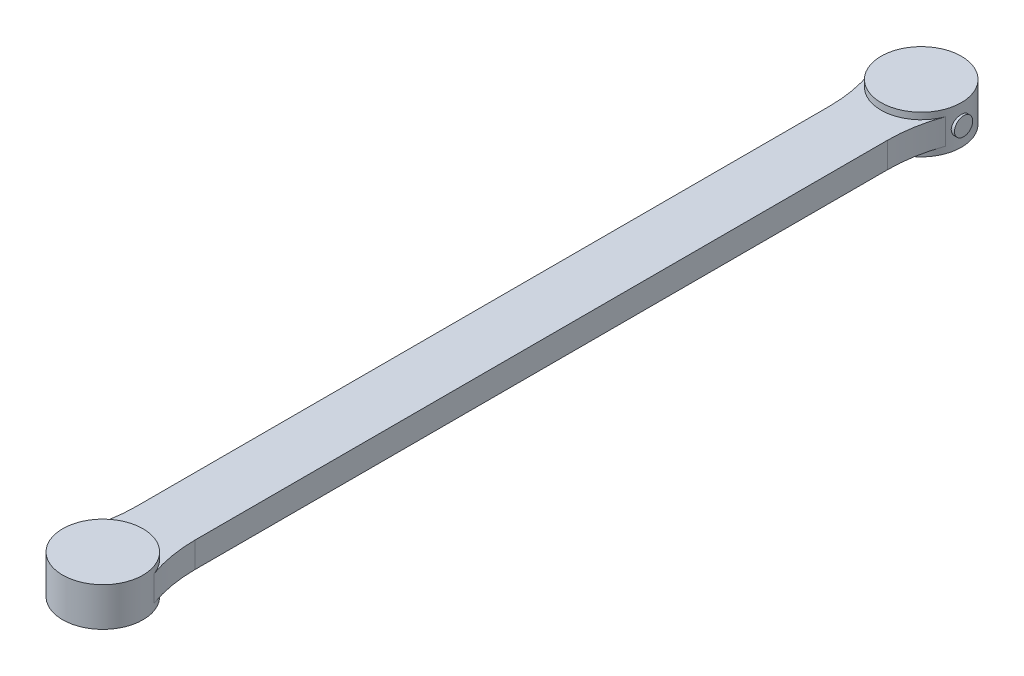
ISO-10303-21;
HEADER;
FILE_DESCRIPTION(('STEP AP214'),'2;1');
FILE_NAME('part.step','',(''),(''),'','','');
FILE_SCHEMA(('AUTOMOTIVE_DESIGN { 1 0 10303 214 1 1 1 1 }'));
ENDSEC;
DATA;
#1=APPLICATION_CONTEXT('core data for automotive mechanical design processes');
#2=APPLICATION_PROTOCOL_DEFINITION('international standard','automotive_design',2000,#1);
#3=PRODUCT_CONTEXT('',#1,'mechanical');
#4=PRODUCT('Part','Part','',(#3));
#5=PRODUCT_RELATED_PRODUCT_CATEGORY('part','',(#4));
#6=PRODUCT_DEFINITION_FORMATION('','',#4);
#7=PRODUCT_DEFINITION_CONTEXT('part definition',#1,'design');
#8=PRODUCT_DEFINITION('design','',#6,#7);
#9=PRODUCT_DEFINITION_SHAPE('','',#8);
#10=(LENGTH_UNIT() NAMED_UNIT(*) SI_UNIT(.MILLI.,.METRE.));
#11=(NAMED_UNIT(*) PLANE_ANGLE_UNIT() SI_UNIT($,.RADIAN.));
#12=(NAMED_UNIT(*) SI_UNIT($,.STERADIAN.) SOLID_ANGLE_UNIT());
#13=UNCERTAINTY_MEASURE_WITH_UNIT(LENGTH_MEASURE(1.E-05),#10,'distance_accuracy_value','');
#14=(GEOMETRIC_REPRESENTATION_CONTEXT(3) GLOBAL_UNCERTAINTY_ASSIGNED_CONTEXT((#13)) GLOBAL_UNIT_ASSIGNED_CONTEXT((#10,
#11,#12)) REPRESENTATION_CONTEXT('',''));
#15=CARTESIAN_POINT('',(0.,0.,0.));
#16=DIRECTION('',(0.,0.,1.));
#17=DIRECTION('',(1.,0.,0.));
#18=AXIS2_PLACEMENT_3D('',#15,#16,#17);
#19=CARTESIAN_POINT('',(-58.,39.15,-12.65));
#20=DIRECTION('',(-1.,0.,0.));
#21=DIRECTION('',(0.,-1.,0.));
#22=AXIS2_PLACEMENT_3D('',#19,#20,#21);
#23=PLANE('',#22);
#24=CARTESIAN_POINT('',(-58.,26.5,0.));
#25=DIRECTION('',(-1.,0.,0.));
#26=DIRECTION('',(0.,-1.,0.));
#27=AXIS2_PLACEMENT_3D('',#24,#25,#26);
#28=CIRCLE('',#27,12.5);
#29=CARTESIAN_POINT('',(-58.,14.,0.));
#30=VERTEX_POINT('',#29);
#31=EDGE_CURVE('E94',#30,#30,#28,.F.);
#32=ORIENTED_EDGE('',*,*,#31,.F.);
#33=EDGE_LOOP('',(#32));
#34=FACE_BOUND('',#33,.T.);
#35=ADVANCED_FACE('F18',(#34),#23,.T.);
#36=CARTESIAN_POINT('',(-55.66,53.,-55.66));
#37=DIRECTION('',(0.,1.,0.));
#38=DIRECTION('',(0.,0.,1.));
#39=AXIS2_PLACEMENT_3D('',#36,#37,#38);
#40=PLANE('',#39);
#41=CARTESIAN_POINT('',(0.,53.,0.));
#42=DIRECTION('',(0.,-1.,0.));
#43=DIRECTION('',(1.,0.,0.));
#44=AXIS2_PLACEMENT_3D('',#41,#42,#43);
#45=CIRCLE('',#44,55.);
#46=CARTESIAN_POINT('',(55.,53.,0.));
#47=VERTEX_POINT('',#46);
#48=EDGE_CURVE('E93',#47,#47,#45,.T.);
#49=ORIENTED_EDGE('',*,*,#48,.F.);
#50=EDGE_LOOP('',(#49));
#51=FACE_BOUND('',#50,.T.);
#52=ADVANCED_FACE('F402',(#51),#40,.T.);
#53=CARTESIAN_POINT('',(-55.66,0.,55.66));
#54=DIRECTION('',(0.,-1.,0.));
#55=DIRECTION('',(0.,0.,-1.));
#56=AXIS2_PLACEMENT_3D('',#53,#54,#55);
#57=PLANE('',#56);
#58=CARTESIAN_POINT('',(0.,0.,0.));
#59=DIRECTION('',(0.,-1.,0.));
#60=DIRECTION('',(1.,0.,0.));
#61=AXIS2_PLACEMENT_3D('',#58,#59,#60);
#62=CIRCLE('',#61,55.);
#63=CARTESIAN_POINT('',(55.0000000000001,0.,0.));
#64=VERTEX_POINT('',#63);
#65=EDGE_CURVE('E149',#64,#64,#62,.F.);
#66=ORIENTED_EDGE('',*,*,#65,.F.);
#67=EDGE_LOOP('',(#66));
#68=FACE_BOUND('',#67,.T.);
#69=ADVANCED_FACE('F161',(#68),#57,.T.);
#70=CARTESIAN_POINT('',(-53.0687858288068,26.5,0.));
#71=DIRECTION('',(-1.,0.,0.));
#72=DIRECTION('',(0.,-1.,0.));
#73=AXIS2_PLACEMENT_3D('',#70,#71,#72);
#74=CYLINDRICAL_SURFACE('',#73,12.5);
#75=ORIENTED_EDGE('',*,*,#31,.T.);
#76=EDGE_LOOP('',(#75));
#77=FACE_BOUND('',#76,.T.);
#78=CARTESIAN_POINT('',(-53.5607134697734,26.4947663423016,-12.499998904353));
#79=CARTESIAN_POINT('',(-53.5607482616599,26.1485573400344,-12.4998522437594));
#80=CARTESIAN_POINT('',(-53.5641470467891,25.80231856991,-12.4853133851922));
#81=CARTESIAN_POINT('',(-53.5775751703,25.112342213812,-12.4275620081104));
#82=CARTESIAN_POINT('',(-53.5876054444424,24.7686049877497,-12.3843454429185));
#83=CARTESIAN_POINT('',(-53.6140033773744,24.0859235040493,-12.2695602519475));
#84=CARTESIAN_POINT('',(-53.6303749534224,23.7469823435302,-12.1979741005842));
#85=CARTESIAN_POINT('',(-53.668967767952,23.0765341556596,-12.0270347036242));
#86=CARTESIAN_POINT('',(-53.6911888169191,22.7450268878382,-11.9276823576058));
#87=CARTESIAN_POINT('',(-53.7408002553822,22.0921135556856,-11.702123481989));
#88=CARTESIAN_POINT('',(-53.7681846299077,21.7706962403507,-11.5759481779728));
#89=CARTESIAN_POINT('',(-53.8273517948584,21.1397319882331,-11.2976291869586));
#90=CARTESIAN_POINT('',(-53.8591346166243,20.8301851360522,-11.1454853149225));
#91=CARTESIAN_POINT('',(-53.9261987788767,20.2250212236511,-10.8163430445573));
#92=CARTESIAN_POINT('',(-53.9614799520433,19.9294034982224,-10.6393458347507));
#93=CARTESIAN_POINT('',(-54.0345635666077,19.3539855621761,-10.2617207488499));
#94=CARTESIAN_POINT('',(-54.0723661098822,19.0741859915402,-10.0610919176629));
#95=CARTESIAN_POINT('',(-54.1500896852431,18.5277635447055,-9.63408702506269));
#96=CARTESIAN_POINT('',(-54.1900352786087,18.2614316509306,-9.40734298778688));
#97=CARTESIAN_POINT('',(-54.2703476102174,17.7487285502313,-8.93237739203031));
#98=CARTESIAN_POINT('',(-54.3107143529023,17.5023575540705,-8.68415560682687));
#99=CARTESIAN_POINT('',(-54.3907554776579,17.031198739328,-8.16786079571903));
#100=CARTESIAN_POINT('',(-54.4304297942619,16.8064129526129,-7.89978590519382));
#101=CARTESIAN_POINT('',(-54.507987101163,16.3799887958768,-7.34558468157226));
#102=CARTESIAN_POINT('',(-54.5458701386551,16.1783498158036,-7.05945882453136));
#103=CARTESIAN_POINT('',(-54.6192175579851,15.797464667222,-6.46768570682239));
#104=CARTESIAN_POINT('',(-54.6546494125235,15.6185002395025,-6.16185296298604));
#105=CARTESIAN_POINT('',(-54.7216090962416,15.287022500875,-5.53575681952974));
#106=CARTESIAN_POINT('',(-54.7531368866475,15.134509452667,-5.2154932766312));
#107=CARTESIAN_POINT('',(-54.81138579185,14.8571305525865,-4.5628179454658));
#108=CARTESIAN_POINT('',(-54.8381073580488,14.7322621040691,-4.23040730159084));
#109=CARTESIAN_POINT('',(-54.8859779879262,14.5111618587573,-3.55580454951088));
#110=CARTESIAN_POINT('',(-54.9071271577385,14.4149295165452,-3.21361262774109));
#111=CARTESIAN_POINT('',(-54.9429345933579,14.2532791717637,-2.52781293807036));
#112=CARTESIAN_POINT('',(-54.9576965022542,14.1873679527277,-2.18432680269541));
#113=CARTESIAN_POINT('',(-54.9808251081266,14.0845400489806,-1.4928278206678));
#114=CARTESIAN_POINT('',(-54.9891918701838,14.0476230692053,-1.14481502011805));
#115=CARTESIAN_POINT('',(-54.9992919251691,14.0030970294724,-0.446860954074161));
#116=CARTESIAN_POINT('',(-55.0010259304693,13.9954848221203,-0.0969198997216305));
#117=CARTESIAN_POINT('',(-54.9978129493053,14.0096246020318,0.602335670599039));
#118=CARTESIAN_POINT('',(-54.9928660305461,14.0313762917198,0.951650192880574));
#119=CARTESIAN_POINT('',(-54.9765836841992,14.1033895178022,1.64067881186317));
#120=CARTESIAN_POINT('',(-54.9653672827051,14.153119988882,1.98045138987757));
#121=CARTESIAN_POINT('',(-54.9369400071642,14.2802940123081,2.6545084117949));
#122=CARTESIAN_POINT('',(-54.9197292189295,14.3577371679357,2.98879293418999));
#123=CARTESIAN_POINT('',(-54.8797796954248,14.5397285715369,3.64956847671046));
#124=CARTESIAN_POINT('',(-54.8570407921199,14.644277643439,3.97605925960294));
#125=CARTESIAN_POINT('',(-54.8066475982448,14.8796802843007,4.61902355684276));
#126=CARTESIAN_POINT('',(-54.7789932480629,15.0105341722713,4.93549694965058));
#127=CARTESIAN_POINT('',(-54.7192752551533,15.2987010487219,5.55874913501477));
#128=CARTESIAN_POINT('',(-54.6871788714087,15.4562126474852,5.86543294130285));
#129=CARTESIAN_POINT('',(-54.6196073550504,15.7958330773118,6.46446912009669));
#130=CARTESIAN_POINT('',(-54.5841322125206,15.9779419805648,6.75682145053818));
#131=CARTESIAN_POINT('',(-54.5107474918733,16.3655148036691,7.32533826940192));
#132=CARTESIAN_POINT('',(-54.4728376166202,16.5709815764873,7.60150077411627));
#133=CARTESIAN_POINT('',(-54.3955981345427,17.0038722748758,8.1358337239572));
#134=CARTESIAN_POINT('',(-54.356268504719,17.2312965562469,8.39400387741785));
#135=CARTESIAN_POINT('',(-54.2763513533517,17.7119561123138,8.896280539296));
#136=CARTESIAN_POINT('',(-54.2357554190628,17.9656563653602,9.13994096367138));
#137=CARTESIAN_POINT('',(-54.1553153450137,18.4927529801262,9.60507913817438));
#138=CARTESIAN_POINT('',(-54.1154712169872,18.7661496489344,9.82655654231589));
#139=CARTESIAN_POINT('',(-54.0376619888481,19.3308230734164,10.2458069946912));
#140=CARTESIAN_POINT('',(-53.9996969605371,19.6221005113738,10.4435791375429));
#141=CARTESIAN_POINT('',(-53.9267377644963,20.2205702590432,10.8140003941061));
#142=CARTESIAN_POINT('',(-53.8917435834833,20.5277624975869,10.9866496201498));
#143=CARTESIAN_POINT('',(-53.8256350267905,21.1570417173058,11.3060923770237));
#144=CARTESIAN_POINT('',(-53.7945342405653,21.4791757695083,11.4527960447832));
#145=CARTESIAN_POINT('',(-53.7372825398127,22.1351106142732,11.7184874741397));
#146=CARTESIAN_POINT('',(-53.7111316490901,22.4689114629335,11.8374751024472));
#147=CARTESIAN_POINT('',(-53.6645800649993,23.1457336969865,12.0467568066848));
#148=CARTESIAN_POINT('',(-53.6441785574229,23.48875376924,12.1370549457536));
#149=CARTESIAN_POINT('',(-53.6097530963048,24.1815318690532,12.2882218146625));
#150=CARTESIAN_POINT('',(-53.5957290068311,24.5312897528335,12.3490911717663));
#151=CARTESIAN_POINT('',(-53.5747309587429,25.2271753073688,12.4398683044504));
#152=CARTESIAN_POINT('',(-53.5676087269669,25.5732136368571,12.4704275891453));
#153=CARTESIAN_POINT('',(-53.5600991303189,26.266704145522,12.5026420909821));
#154=CARTESIAN_POINT('',(-53.5597116671896,26.6141563039974,12.5042977298157));
#155=CARTESIAN_POINT('',(-53.5656831059478,27.3079094748114,12.4786923774516));
#156=CARTESIAN_POINT('',(-53.57204154099,27.6542105651453,12.4514333872715));
#157=CARTESIAN_POINT('',(-53.5913115607555,28.3431629523808,12.3682312356931));
#158=CARTESIAN_POINT('',(-53.6042231246845,28.6858142608602,12.3122881653144));
#159=CARTESIAN_POINT('',(-53.6360034418151,29.3605916777322,12.1730912923126));
#160=CARTESIAN_POINT('',(-53.6547927561477,29.6927966574123,12.0902011304137));
#161=CARTESIAN_POINT('',(-53.6978334511686,30.3489611916344,11.8975800590875));
#162=CARTESIAN_POINT('',(-53.7220847710157,30.6729208379764,11.7878494486346));
#163=CARTESIAN_POINT('',(-53.775361126036,31.310445702061,11.5423697018243));
#164=CARTESIAN_POINT('',(-53.8043865301134,31.6240101142888,11.406618554667));
#165=CARTESIAN_POINT('',(-53.8663975432155,32.2386664879318,11.1100920629109));
#166=CARTESIAN_POINT('',(-53.8993832195024,32.5397582373913,10.949316293274));
#167=CARTESIAN_POINT('',(-53.9689789485336,33.1323994526184,10.6010073987574));
#168=CARTESIAN_POINT('',(-54.0056399296582,33.4237086793039,10.4130756474223));
#169=CARTESIAN_POINT('',(-54.081092440821,33.9895392033427,10.0138253772918));
#170=CARTESIAN_POINT('',(-54.1198839903844,34.264060346796,9.80250664415243));
#171=CARTESIAN_POINT('',(-54.1985335298183,34.7945689205524,9.35788025317923));
#172=CARTESIAN_POINT('',(-54.238391646398,35.0505541352626,9.12456997435021));
#173=CARTESIAN_POINT('',(-54.3180832818846,35.5422923894869,8.63751749184176));
#174=CARTESIAN_POINT('',(-54.3579168005994,35.7780452729851,8.38377513063527));
#175=CARTESIAN_POINT('',(-54.4372776451922,36.2323296642538,7.85216321033794));
#176=CARTESIAN_POINT('',(-54.4767823734271,36.4504148873909,7.57390867165338));
#177=CARTESIAN_POINT('',(-54.553531756147,36.8623741676212,6.99971822101221));
#178=CARTESIAN_POINT('',(-54.5907763763593,37.0562478576146,6.70378204106384));
#179=CARTESIAN_POINT('',(-54.6619540414377,37.418367473528,6.0962529737782));
#180=CARTESIAN_POINT('',(-54.6958871877749,37.5866141848049,5.78466056662642));
#181=CARTESIAN_POINT('',(-54.7594808284976,37.8962145424004,5.14797006022962));
#182=CARTESIAN_POINT('',(-54.7891413770722,38.0375685298054,4.82287213234183));
#183=CARTESIAN_POINT('',(-54.8431599259702,38.2914153652615,4.16370208480639));
#184=CARTESIAN_POINT('',(-54.8675523646368,38.4040965720988,3.82970534655251));
#185=CARTESIAN_POINT('',(-54.9105931726765,38.6009286853609,3.15304213482943));
#186=CARTESIAN_POINT('',(-54.9292415547828,38.6850796550303,2.81037568058072));
#187=CARTESIAN_POINT('',(-54.9602574718859,38.824143022926,2.11892485053318));
#188=CARTESIAN_POINT('',(-54.9726258334048,38.8790592688201,1.77014128606975));
#189=CARTESIAN_POINT('',(-54.9907281372346,38.9592018714425,1.06901061693368));
#190=CARTESIAN_POINT('',(-54.9964621968112,38.98442875295,0.716663575358885));
#191=CARTESIAN_POINT('',(-55.0010782139572,39.0047468393642,0.0189760326154543));
#192=CARTESIAN_POINT('',(-55.0001109999007,39.0005013861494,-0.326344330294638));
#193=CARTESIAN_POINT('',(-54.9917060085383,38.9634688272986,-1.01536770370898));
#194=CARTESIAN_POINT('',(-54.9842683346334,38.9306821777643,-1.35907073997062));
#195=CARTESIAN_POINT('',(-54.963128532644,38.8368384464817,-2.04238808354299));
#196=CARTESIAN_POINT('',(-54.9494265670824,38.7757820981712,-2.3820024966957));
#197=CARTESIAN_POINT('',(-54.9161355076077,38.6258926391777,-3.05474929206963));
#198=CARTESIAN_POINT('',(-54.8965463882226,38.537059408312,-3.38788164623817));
#199=CARTESIAN_POINT('',(-54.852099677743,38.3326978908941,-4.04412266571418));
#200=CARTESIAN_POINT('',(-54.8272619605734,38.2172701601162,-4.36726401487796));
#201=CARTESIAN_POINT('',(-54.7729435747405,37.9604142234209,-5.00263174852972));
#202=CARTESIAN_POINT('',(-54.7434629292087,37.8189861470394,-5.31485818738749));
#203=CARTESIAN_POINT('',(-54.6806428930991,37.5111489822576,-5.92636350375961));
#204=CARTESIAN_POINT('',(-54.6473032089742,37.3447379931857,-6.22564139392956));
#205=CARTESIAN_POINT('',(-54.5776497668412,36.9881088061136,-6.80929809338319));
#206=CARTESIAN_POINT('',(-54.5413359389321,36.7978900485069,-7.0936765522297));
#207=CARTESIAN_POINT('',(-54.4659323523214,36.3908334384018,-7.65133928882605));
#208=CARTESIAN_POINT('',(-54.426801159912,36.1735329245192,-7.92428034858755));
#209=CARTESIAN_POINT('',(-54.347511524634,35.7169699802285,-8.45097232139746));
#210=CARTESIAN_POINT('',(-54.307353066359,35.4777072203004,-8.70472294640973));
#211=CARTESIAN_POINT('',(-54.2271029095966,34.9787567397797,-9.19141814649082));
#212=CARTESIAN_POINT('',(-54.1870112293348,34.7190641569076,-9.42435774020906));
#213=CARTESIAN_POINT('',(-54.1080142749446,34.1810159992312,-9.86780261130049));
#214=CARTESIAN_POINT('',(-54.0691089967957,33.9026604876817,-10.0783079647046));
#215=CARTESIAN_POINT('',(-53.993017550921,33.3248906330286,-10.4783652903304));
#216=CARTESIAN_POINT('',(-53.9558650868616,33.0252267593938,-10.6675635160911));
#217=CARTESIAN_POINT('',(-53.8849898564359,32.4106083503584,-11.0199906365358));
#218=CARTESIAN_POINT('',(-53.8512670734297,32.0956538891542,-11.1832196572164));
#219=CARTESIAN_POINT('',(-53.7882770098459,31.4528744685871,-11.4823610663935));
#220=CARTESIAN_POINT('',(-53.7590065938096,31.1250587729679,-11.6182927001366));
#221=CARTESIAN_POINT('',(-53.7057829592263,30.4587046028931,-11.8618905683441));
#222=CARTESIAN_POINT('',(-53.6818288232906,30.1201679900011,-11.9695616800909));
#223=CARTESIAN_POINT('',(-53.6446013812838,29.5106919698835,-12.1351649518896));
#224=CARTESIAN_POINT('',(-53.6301375357205,29.2413668320368,-12.1988311413342));
#225=CARTESIAN_POINT('',(-53.6051476911239,28.698916325948,-12.3081801477156));
#226=CARTESIAN_POINT('',(-53.5946213999576,28.4257912411897,-12.3538642987799));
#227=CARTESIAN_POINT('',(-53.5777078243301,27.8769577844639,-12.4270123780897));
#228=CARTESIAN_POINT('',(-53.5713209317276,27.6012491704304,-12.4544745813492));
#229=CARTESIAN_POINT('',(-53.5628103002779,27.0486219843252,-12.491024515095));
#230=CARTESIAN_POINT('',(-53.5606856392647,26.7717036869741,-12.5001162201799));
#231=CARTESIAN_POINT('',(-53.5607134697734,26.4947663423016,-12.499998904353));
#232=B_SPLINE_CURVE_WITH_KNOTS('',3,(#78,#79,#80,#81,#82,#83,#84,#85,#86,#87,#88,#89,#90,#91,
#92,#93,#94,#95,#96,#97,#98,#99,#100,#101,#102,#103,#104,#105,#106,#107,#108,#109,#110,#111,
#112,#113,#114,#115,#116,#117,#118,#119,#120,#121,#122,#123,#124,#125,#126,#127,#128,#129,#130,
#131,#132,#133,#134,#135,#136,#137,#138,#139,#140,#141,#142,#143,#144,#145,#146,#147,#148,#149,
#150,#151,#152,#153,#154,#155,#156,#157,#158,#159,#160,#161,#162,#163,#164,#165,#166,#167,#168,
#169,#170,#171,#172,#173,#174,#175,#176,#177,#178,#179,#180,#181,#182,#183,#184,#185,#186,#187,
#188,#189,#190,#191,#192,#193,#194,#195,#196,#197,#198,#199,#200,#201,#202,#203,#204,#205,#206,
#207,#208,#209,#210,#211,#212,#213,#214,#215,#216,#217,#218,#219,#220,#221,#222,#223,#224,#225,
#226,#227,#228,#229,#230,#231),.UNSPECIFIED.,.T.,.F.,(4,2,2,2,2,2,2,2,2,2,2,2,2,2,2,2,2,2,2,2,2,
2,2,2,2,2,2,2,2,2,2,2,2,2,2,2,2,2,2,2,2,2,2,2,2,2,2,2,2,2,2,2,2,2,2,2,2,2,2,2,2,2,2,2,2,2,2,2,2,
2,2,2,2,2,2,2,4),(0.,1.03837527303575,2.07689710114041,3.11606148865112,4.15519221287687,
5.19311980751196,6.23105479817529,7.26894017018083,8.30686750364489,9.36179965033773,
10.4167429344283,11.4717854256669,12.5268001040496,13.593852023617,14.6609145399213,
15.7278767849519,16.7948187067853,17.8437316697261,18.8926339581093,19.9414235890254,
20.9902025915169,22.0197155533293,23.0492137778218,24.0787432992582,25.1082853070413,
26.1458657728773,27.1834492839299,28.2211596634961,29.2588868610087,30.3199206117618,
31.3809709087651,32.4420617178748,33.5031477823817,34.5678398860867,35.6325371099046,
36.6970834790709,37.7616071568217,38.8027182731843,39.8438142001734,40.8848380835163,
41.9258586635307,42.9533768543291,43.9808836001733,45.0084697811178,46.0360734173064,
47.0806757019419,48.1252875612488,49.1700240772265,50.2147686486749,51.2807035680204,
52.346654647307,53.4125730531932,54.478477938898,55.5371884990588,56.595896712296,
57.6544655513668,58.7130156792524,59.7478192277273,60.7826062398604,61.8173664066668,
62.8521310506525,63.8830455812194,64.9139549758211,65.9449428406209,66.9759549435546,
68.0279337625904,69.0799283680214,70.1321741091123,71.1844162839674,72.2521358641035,
73.3198502637455,74.3868092383135,75.4535839527624,76.2843574088401,77.1150692163551,
77.9458596522301,78.7764703209442),.UNSPECIFIED.);
#233=CARTESIAN_POINT('',(-53.5607134697734,26.4947663423016,-12.499998904353));
#234=VERTEX_POINT('',#233);
#235=EDGE_CURVE('E141',#234,#234,#232,.F.);
#236=ORIENTED_EDGE('',*,*,#235,.F.);
#237=EDGE_LOOP('',(#236));
#238=FACE_BOUND('',#237,.T.);
#239=ADVANCED_FACE('F155',(#77,#238),#74,.T.);
#240=CARTESIAN_POINT('',(58.,13.85,-1132.65));
#241=DIRECTION('',(1.,0.,0.));
#242=DIRECTION('',(0.,1.,0.));
#243=AXIS2_PLACEMENT_3D('',#240,#241,#242);
#244=PLANE('',#243);
#245=CARTESIAN_POINT('',(58.,26.5,-1120.));
#246=DIRECTION('',(1.,0.,0.));
#247=DIRECTION('',(0.,1.,0.));
#248=AXIS2_PLACEMENT_3D('',#245,#246,#247);
#249=CIRCLE('',#248,12.5);
#250=CARTESIAN_POINT('',(58.,39.,-1120.));
#251=VERTEX_POINT('',#250);
#252=EDGE_CURVE('E131',#251,#251,#249,.F.);
#253=ORIENTED_EDGE('',*,*,#252,.F.);
#254=EDGE_LOOP('',(#253));
#255=FACE_BOUND('',#254,.T.);
#256=ADVANCED_FACE('F160',(#255),#244,.T.);
#257=CARTESIAN_POINT('',(-40.,9.,-1033.83156030193));
#258=DIRECTION('',(-1.,0.,0.));
#259=DIRECTION('',(0.,0.,1.));
#260=AXIS2_PLACEMENT_3D('',#257,#258,#259);
#261=PLANE('',#260);
#262=DIRECTION('',(0.,0.,1.));
#263=VECTOR('',#262,1.);
#264=CARTESIAN_POINT('',(-40.,44.,-1107.91162606433));
#265=LINE('',#264,#263);
#266=CARTESIAN_POINT('',(-40.,44.,-1033.83156030193));
#267=VERTEX_POINT('',#266);
#268=CARTESIAN_POINT('',(-40.,44.,-86.1684396980704));
#269=VERTEX_POINT('',#268);
#270=EDGE_CURVE('E88',#267,#269,#265,.T.);
#271=ORIENTED_EDGE('',*,*,#270,.F.);
#272=DIRECTION('',(0.,-1.,0.));
#273=VECTOR('',#272,1.);
#274=CARTESIAN_POINT('',(-40.,44.,-1033.83156030193));
#275=LINE('',#274,#273);
#276=CARTESIAN_POINT('',(-40.,9.,-1033.83156030193));
#277=VERTEX_POINT('',#276);
#278=EDGE_CURVE('E106',#277,#267,#275,.F.);
#279=ORIENTED_EDGE('',*,*,#278,.F.);
#280=DIRECTION('',(0.,0.,-1.));
#281=VECTOR('',#280,1.);
#282=CARTESIAN_POINT('',(-40.,9.,-12.0883739356652));
#283=LINE('',#282,#281);
#284=CARTESIAN_POINT('',(-40.,9.,-86.1684396980703));
#285=VERTEX_POINT('',#284);
#286=EDGE_CURVE('E89',#285,#277,#283,.T.);
#287=ORIENTED_EDGE('',*,*,#286,.F.);
#288=DIRECTION('',(0.,-1.,0.));
#289=VECTOR('',#288,1.);
#290=CARTESIAN_POINT('',(-40.,44.,-86.1684396980704));
#291=LINE('',#290,#289);
#292=EDGE_CURVE('E83',#269,#285,#291,.T.);
#293=ORIENTED_EDGE('',*,*,#292,.F.);
#294=EDGE_LOOP('',(#271,#279,#287,#293));
#295=FACE_BOUND('',#294,.T.);
#296=ADVANCED_FACE('F85',(#295),#261,.T.);
#297=CARTESIAN_POINT('',(-240.,43.9999999999986,-86.1684396980704));
#298=DIRECTION('',(0.,-1.,0.));
#299=DIRECTION('',(1.,0.,0.));
#300=AXIS2_PLACEMENT_3D('',#297,#298,#299);
#301=CYLINDRICAL_SURFACE('',#300,200.);
#302=CARTESIAN_POINT('',(-240.,8.99999999999862,-86.1684396980703));
#303=DIRECTION('',(0.,-1.,0.));
#304=DIRECTION('',(1.,0.,0.));
#305=AXIS2_PLACEMENT_3D('',#302,#303,#304);
#306=CIRCLE('',#305,200.);
#307=CARTESIAN_POINT('',(-51.7647058823528,8.99999999999986,-18.5853497387994));
#308=VERTEX_POINT('',#307);
#309=EDGE_CURVE('E124',#308,#285,#306,.F.);
#310=ORIENTED_EDGE('',*,*,#309,.F.);
#311=DIRECTION('',(0.,-1.,0.));
#312=VECTOR('',#311,1.);
#313=CARTESIAN_POINT('',(-51.764705882353,106.,-18.5853497387994));
#314=LINE('',#313,#312);
#315=CARTESIAN_POINT('',(-51.7647058823529,44.,-18.5853497387995));
#316=VERTEX_POINT('',#315);
#317=EDGE_CURVE('E100',#316,#308,#314,.T.);
#318=ORIENTED_EDGE('',*,*,#317,.F.);
#319=CARTESIAN_POINT('',(-240.,43.9999999999986,-86.1684396980704));
#320=DIRECTION('',(0.,-1.,0.));
#321=DIRECTION('',(1.,0.,0.));
#322=AXIS2_PLACEMENT_3D('',#319,#320,#321);
#323=CIRCLE('',#322,200.);
#324=EDGE_CURVE('E98',#269,#316,#323,.T.);
#325=ORIENTED_EDGE('',*,*,#324,.F.);
#326=ORIENTED_EDGE('',*,*,#292,.T.);
#327=EDGE_LOOP('',(#310,#318,#325,#326));
#328=FACE_BOUND('',#327,.T.);
#329=ADVANCED_FACE('F99',(#328),#301,.F.);
#330=CARTESIAN_POINT('',(0.,106.,0.));
#331=DIRECTION('',(0.,-1.,0.));
#332=DIRECTION('',(1.,0.,0.));
#333=AXIS2_PLACEMENT_3D('',#330,#331,#332);
#334=CYLINDRICAL_SURFACE('',#333,55.);
#335=CARTESIAN_POINT('',(0.,44.,0.));
#336=DIRECTION('',(0.,-1.,0.));
#337=DIRECTION('',(1.,0.,0.));
#338=AXIS2_PLACEMENT_3D('',#335,#336,#337);
#339=CIRCLE('',#338,55.);
#340=CARTESIAN_POINT('',(51.7647058823529,44.,-18.5853497387993));
#341=VERTEX_POINT('',#340);
#342=EDGE_CURVE('E103',#316,#341,#339,.T.);
#343=ORIENTED_EDGE('',*,*,#342,.F.);
#344=ORIENTED_EDGE('',*,*,#317,.T.);
#345=CARTESIAN_POINT('',(0.,9.,0.));
#346=DIRECTION('',(0.,-1.,0.));
#347=DIRECTION('',(1.,0.,0.));
#348=AXIS2_PLACEMENT_3D('',#345,#346,#347);
#349=CIRCLE('',#348,55.);
#350=CARTESIAN_POINT('',(51.7647058823529,8.99999999999986,-18.5853497387993));
#351=VERTEX_POINT('',#350);
#352=EDGE_CURVE('E126',#351,#308,#349,.F.);
#353=ORIENTED_EDGE('',*,*,#352,.F.);
#354=DIRECTION('',(0.,-1.,0.));
#355=VECTOR('',#354,1.);
#356=CARTESIAN_POINT('',(51.7647058823529,44.,-18.5853497387993));
#357=LINE('',#356,#355);
#358=EDGE_CURVE('E138',#341,#351,#357,.T.);
#359=ORIENTED_EDGE('',*,*,#358,.F.);
#360=EDGE_LOOP('',(#343,#344,#353,#359));
#361=FACE_BOUND('',#360,.T.);
#362=ORIENTED_EDGE('',*,*,#65,.T.);
#363=EDGE_LOOP('',(#362));
#364=FACE_BOUND('',#363,.T.);
#365=ORIENTED_EDGE('',*,*,#235,.T.);
#366=EDGE_LOOP('',(#365));
#367=FACE_BOUND('',#366,.T.);
#368=ORIENTED_EDGE('',*,*,#48,.T.);
#369=EDGE_LOOP('',(#368));
#370=FACE_BOUND('',#369,.T.);
#371=ADVANCED_FACE('F151',(#361,#364,#367,#370),#334,.T.);
#372=CARTESIAN_POINT('',(240.,43.9999999999986,-86.1684396980704));
#373=DIRECTION('',(0.,-1.,0.));
#374=DIRECTION('',(1.,0.,0.));
#375=AXIS2_PLACEMENT_3D('',#372,#373,#374);
#376=CYLINDRICAL_SURFACE('',#375,200.);
#377=CARTESIAN_POINT('',(240.,8.99999999999862,-86.1684396980703));
#378=DIRECTION('',(0.,-1.,0.));
#379=DIRECTION('',(1.,0.,0.));
#380=AXIS2_PLACEMENT_3D('',#377,#378,#379);
#381=CIRCLE('',#380,200.);
#382=CARTESIAN_POINT('',(40.,9.,-86.1684396980703));
#383=VERTEX_POINT('',#382);
#384=EDGE_CURVE('E114',#383,#351,#381,.F.);
#385=ORIENTED_EDGE('',*,*,#384,.F.);
#386=DIRECTION('',(0.,1.,0.));
#387=VECTOR('',#386,1.);
#388=CARTESIAN_POINT('',(40.,9.,-86.1684396980703));
#389=LINE('',#388,#387);
#390=CARTESIAN_POINT('',(40.,44.,-86.1684396980704));
#391=VERTEX_POINT('',#390);
#392=EDGE_CURVE('E134',#391,#383,#389,.F.);
#393=ORIENTED_EDGE('',*,*,#392,.F.);
#394=CARTESIAN_POINT('',(240.,43.9999999999986,-86.1684396980704));
#395=DIRECTION('',(0.,-1.,0.));
#396=DIRECTION('',(1.,0.,0.));
#397=AXIS2_PLACEMENT_3D('',#394,#395,#396);
#398=CIRCLE('',#397,200.);
#399=EDGE_CURVE('E210',#341,#391,#398,.T.);
#400=ORIENTED_EDGE('',*,*,#399,.F.);
#401=ORIENTED_EDGE('',*,*,#358,.T.);
#402=EDGE_LOOP('',(#385,#393,#400,#401));
#403=FACE_BOUND('',#402,.T.);
#404=ADVANCED_FACE('F173',(#403),#376,.F.);
#405=CARTESIAN_POINT('',(40.,9.,-86.1684396980704));
#406=DIRECTION('',(1.,0.,0.));
#407=DIRECTION('',(0.,0.,-1.));
#408=AXIS2_PLACEMENT_3D('',#405,#406,#407);
#409=PLANE('',#408);
#410=DIRECTION('',(0.,0.,1.));
#411=VECTOR('',#410,1.);
#412=CARTESIAN_POINT('',(40.,44.,-1107.91162606433));
#413=LINE('',#412,#411);
#414=CARTESIAN_POINT('',(40.,44.,-1033.83156030193));
#415=VERTEX_POINT('',#414);
#416=EDGE_CURVE('E207',#391,#415,#413,.F.);
#417=ORIENTED_EDGE('',*,*,#416,.F.);
#418=ORIENTED_EDGE('',*,*,#392,.T.);
#419=DIRECTION('',(0.,0.,-1.));
#420=VECTOR('',#419,1.);
#421=CARTESIAN_POINT('',(40.,9.,-12.0883739356652));
#422=LINE('',#421,#420);
#423=CARTESIAN_POINT('',(40.,9.,-1033.83156030193));
#424=VERTEX_POINT('',#423);
#425=EDGE_CURVE('E117',#424,#383,#422,.F.);
#426=ORIENTED_EDGE('',*,*,#425,.F.);
#427=DIRECTION('',(0.,-1.,0.));
#428=VECTOR('',#427,1.);
#429=CARTESIAN_POINT('',(40.,44.,-1033.83156030193));
#430=LINE('',#429,#428);
#431=EDGE_CURVE('E129',#415,#424,#430,.T.);
#432=ORIENTED_EDGE('',*,*,#431,.F.);
#433=EDGE_LOOP('',(#417,#418,#426,#432));
#434=FACE_BOUND('',#433,.T.);
#435=ADVANCED_FACE('F219',(#434),#409,.T.);
#436=CARTESIAN_POINT('',(-55.66,53.,-1175.66));
#437=DIRECTION('',(0.,1.,0.));
#438=DIRECTION('',(0.,0.,1.));
#439=AXIS2_PLACEMENT_3D('',#436,#437,#438);
#440=PLANE('',#439);
#441=CARTESIAN_POINT('',(0.,53.,-1120.));
#442=DIRECTION('',(0.,-1.,0.));
#443=DIRECTION('',(1.,0.,0.));
#444=AXIS2_PLACEMENT_3D('',#441,#442,#443);
#445=CIRCLE('',#444,55.);
#446=CARTESIAN_POINT('',(55.,53.,-1120.));
#447=VERTEX_POINT('',#446);
#448=EDGE_CURVE('E194',#447,#447,#445,.T.);
#449=ORIENTED_EDGE('',*,*,#448,.F.);
#450=EDGE_LOOP('',(#449));
#451=FACE_BOUND('',#450,.T.);
#452=ADVANCED_FACE('F324',(#451),#440,.T.);
#453=CARTESIAN_POINT('',(-55.66,0.,-1064.34));
#454=DIRECTION('',(0.,-1.,0.));
#455=DIRECTION('',(0.,0.,-1.));
#456=AXIS2_PLACEMENT_3D('',#453,#454,#455);
#457=PLANE('',#456);
#458=CARTESIAN_POINT('',(0.,0.,-1120.));
#459=DIRECTION('',(0.,-1.,0.));
#460=DIRECTION('',(1.,0.,0.));
#461=AXIS2_PLACEMENT_3D('',#458,#459,#460);
#462=CIRCLE('',#461,55.);
#463=CARTESIAN_POINT('',(55.0000000000001,0.,-1120.));
#464=VERTEX_POINT('',#463);
#465=EDGE_CURVE('E184',#464,#464,#462,.F.);
#466=ORIENTED_EDGE('',*,*,#465,.F.);
#467=EDGE_LOOP('',(#466));
#468=FACE_BOUND('',#467,.T.);
#469=ADVANCED_FACE('F240',(#468),#457,.T.);
#470=CARTESIAN_POINT('',(53.0687858288068,26.5,-1120.));
#471=DIRECTION('',(1.,0.,0.));
#472=DIRECTION('',(0.,1.,0.));
#473=AXIS2_PLACEMENT_3D('',#470,#471,#472);
#474=CYLINDRICAL_SURFACE('',#473,12.5);
#475=ORIENTED_EDGE('',*,*,#252,.T.);
#476=EDGE_LOOP('',(#475));
#477=FACE_BOUND('',#476,.T.);
#478=CARTESIAN_POINT('',(53.5607134697736,26.5052336576973,-1107.50000109565));
#479=CARTESIAN_POINT('',(53.5606806034905,26.159041514018,-1107.49985785167));
#480=CARTESIAN_POINT('',(53.5640113961148,25.8128069260373,-1107.51410537346));
#481=CARTESIAN_POINT('',(53.5773049275632,25.1228133672726,-1107.57127368952));
#482=CARTESIAN_POINT('',(53.5872686011787,24.7790547523384,-1107.61419852538));
#483=CARTESIAN_POINT('',(53.6135366843291,24.0963053966368,-1107.72840205506));
#484=CARTESIAN_POINT('',(53.629845007815,23.7573177330336,-1107.79969825151));
#485=CARTESIAN_POINT('',(53.6683165851812,23.0867516928376,-1107.97006198974));
#486=CARTESIAN_POINT('',(53.6904796495939,22.7551730768542,-1108.06912863283));
#487=CARTESIAN_POINT('',(53.7399821466136,22.1020926247797,-1108.29412289574));
#488=CARTESIAN_POINT('',(53.7673155645291,21.7805795809076,-1108.42001932571));
#489=CARTESIAN_POINT('',(53.8263891400086,21.1494009531431,-1108.6977887348));
#490=CARTESIAN_POINT('',(53.8581293289531,20.8397354536364,-1108.8496618989));
#491=CARTESIAN_POINT('',(53.9251176826054,20.2343123293003,-1109.17827256969));
#492=CARTESIAN_POINT('',(53.9603656801884,19.9385540428685,-1109.35500889198));
#493=CARTESIAN_POINT('',(54.0333932390876,19.3628341478766,-1109.73212343045));
#494=CARTESIAN_POINT('',(54.0711729027865,19.0828731790187,-1109.93250260301));
#495=CARTESIAN_POINT('',(54.1488608000187,18.5361088316961,-1110.35901401468));
#496=CARTESIAN_POINT('',(54.1887937545123,18.2695958748055,-1110.585514142));
#497=CARTESIAN_POINT('',(54.2690923646668,17.7565105989523,-1111.06000579018));
#498=CARTESIAN_POINT('',(54.309458024885,17.5099384902448,-1111.30799753758));
#499=CARTESIAN_POINT('',(54.3895086488352,17.0383581797266,-1111.82384772572));
#500=CARTESIAN_POINT('',(54.4291935479817,16.8133520147425,-1112.09170803876));
#501=CARTESIAN_POINT('',(54.5067834962097,16.3864688304267,-1112.64549715044));
#502=CARTESIAN_POINT('',(54.5446885920328,16.1845912034862,-1112.93142547412));
#503=CARTESIAN_POINT('',(54.6180940789897,15.8031950771346,-1113.52284122593));
#504=CARTESIAN_POINT('',(54.653561864524,15.623959899522,-1113.82851552609));
#505=CARTESIAN_POINT('',(54.7206032936862,15.2919280727065,-1114.45431775389));
#506=CARTESIAN_POINT('',(54.7521768984638,15.1391316872656,-1114.77444582568));
#507=CARTESIAN_POINT('',(54.8105260696684,14.8611752373072,-1115.42687475104));
#508=CARTESIAN_POINT('',(54.8373020849699,14.7360125870538,-1115.75917446229));
#509=CARTESIAN_POINT('',(54.8852887269811,14.5143151102386,-1116.43358111254));
#510=CARTESIAN_POINT('',(54.9064994595533,14.4177797391258,-1116.77568786485));
#511=CARTESIAN_POINT('',(54.9424352548456,14.2555176564278,-1117.46136357256));
#512=CARTESIAN_POINT('',(54.957263550763,14.1892993618384,-1117.80481082136));
#513=CARTESIAN_POINT('',(54.9805275729393,14.0858565100673,-1118.49625921965));
#514=CARTESIAN_POINT('',(54.9889633639697,14.0486316591124,-1118.84426032297));
#515=CARTESIAN_POINT('',(54.9992021273766,14.0034917149008,-1119.54221810733));
#516=CARTESIAN_POINT('',(55.0010058138856,13.9955734659641,-1119.89217457376));
#517=CARTESIAN_POINT('',(54.9979308661599,14.0091055570889,-1120.59148776657));
#518=CARTESIAN_POINT('',(54.9930523000428,14.0305555977758,-1120.94084449902));
#519=CARTESIAN_POINT('',(54.9769025466842,14.1019763009028,-1121.62996693945));
#520=CARTESIAN_POINT('',(54.9657507323116,14.1514144893938,-1121.96979079583));
#521=CARTESIAN_POINT('',(54.9374483380605,14.2780103056618,-1122.64397492191));
#522=CARTESIAN_POINT('',(54.9202978442041,14.3551675359436,-1122.97833526989));
#523=CARTESIAN_POINT('',(54.8804630416899,14.536595467794,-1123.63928582335));
#524=CARTESIAN_POINT('',(54.8577785667199,14.640866984232,-1123.96587579499));
#525=CARTESIAN_POINT('',(54.8074869677445,14.8757247294042,-1124.60906066285));
#526=CARTESIAN_POINT('',(54.7798797842409,15.0063112761974,-1124.92565543822));
#527=CARTESIAN_POINT('',(54.7202501585467,15.2939429429316,-1125.54914997744));
#528=CARTESIAN_POINT('',(54.6881952112068,15.4511849367392,-1125.85595579064));
#529=CARTESIAN_POINT('',(54.6206974702288,15.7902760672474,-1126.45525782781));
#530=CARTESIAN_POINT('',(54.5852546668229,15.9721252748956,-1126.74775401052));
#531=CARTESIAN_POINT('',(54.5119246147244,16.3591900282332,-1127.31657935101));
#532=CARTESIAN_POINT('',(54.4740370679124,16.5644084259746,-1127.59290652923));
#533=CARTESIAN_POINT('',(54.3968315332792,16.9968151215659,-1128.12758869298));
#534=CARTESIAN_POINT('',(54.3575135222055,17.2240037766465,-1128.38594338616));
#535=CARTESIAN_POINT('',(54.2776083373709,17.7042025002567,-1128.88861394708));
#536=CARTESIAN_POINT('',(54.2370124949519,17.9576779969157,-1129.13248403598));
#537=CARTESIAN_POINT('',(54.1565607343756,18.4843415277978,-1129.59806007198));
#538=CARTESIAN_POINT('',(54.1167048277631,18.757529869262,-1129.81976567349));
#539=CARTESIAN_POINT('',(54.0388602415354,19.3218047548454,-1130.23949016368));
#540=CARTESIAN_POINT('',(54.000871634235,19.6128919911539,-1130.43750813543));
#541=CARTESIAN_POINT('',(53.9278539017518,20.2110010033199,-1130.80843745847));
#542=CARTESIAN_POINT('',(53.8928247635411,20.5180227090237,-1130.98134892026));
#543=CARTESIAN_POINT('',(53.8266328844479,21.1470067567511,-1131.30134491292));
#544=CARTESIAN_POINT('',(53.7954840148607,21.4690173491601,-1131.44833752453));
#545=CARTESIAN_POINT('',(53.7381273933169,22.1247303428384,-1131.71461603321));
#546=CARTESIAN_POINT('',(53.7119196653929,22.4584328009646,-1131.83390179551));
#547=CARTESIAN_POINT('',(53.6652472966351,23.1350845792064,-1132.04378685321));
#548=CARTESIAN_POINT('',(53.644781843703,23.4780325842483,-1132.13439020524));
#549=CARTESIAN_POINT('',(53.6102233063187,24.1706937611872,-1132.28617224272));
#550=CARTESIAN_POINT('',(53.5961300860319,24.5204067887108,-1132.34735155539));
#551=CARTESIAN_POINT('',(53.5749919636648,25.2162420581325,-1132.4387453492));
#552=CARTESIAN_POINT('',(53.5677990605508,25.5622744776684,-1132.46961038653));
#553=CARTESIAN_POINT('',(53.5601477840475,26.2557800351357,-1132.50243408054));
#554=CARTESIAN_POINT('',(53.5596893126043,26.6032531520168,-1132.5043931581));
#555=CARTESIAN_POINT('',(53.565520558116,27.2970744804242,-1132.47938978514));
#556=CARTESIAN_POINT('',(53.5718098052266,27.6434227685882,-1132.45242934829));
#557=CARTESIAN_POINT('',(53.5909453233983,28.3324950313109,-1132.36981698938));
#558=CARTESIAN_POINT('',(53.603791573186,28.6752190176245,-1132.31416516041));
#559=CARTESIAN_POINT('',(53.6354466963148,29.3501410394254,-1132.17554240419));
#560=CARTESIAN_POINT('',(53.6541756289142,29.6824180569177,-1132.09293719818));
#561=CARTESIAN_POINT('',(53.6971019729735,30.3387501332292,-1131.90087861435));
#562=CARTESIAN_POINT('',(53.7212993232814,30.6628052839466,-1131.79142553676));
#563=CARTESIAN_POINT('',(53.7744755667226,31.3005433763157,-1131.5464916967));
#564=CARTESIAN_POINT('',(53.8034548280174,31.614225517111,-1131.41100893005));
#565=CARTESIAN_POINT('',(53.8653825444295,32.2291384043554,-1131.1150084469));
#566=CARTESIAN_POINT('',(53.8983310668739,32.5303689394824,-1130.95449030573));
#567=CARTESIAN_POINT('',(53.9678597628732,33.123292494317,-1130.60669898993));
#568=CARTESIAN_POINT('',(54.0044908441387,33.4147464739562,-1130.41902843185));
#569=CARTESIAN_POINT('',(54.079894174671,33.9808877563678,-1130.02028944098));
#570=CARTESIAN_POINT('',(54.1186664434617,34.2555749062079,-1129.80922079482));
#571=CARTESIAN_POINT('',(54.1972885747834,34.7864359209695,-1129.3650820249));
#572=CARTESIAN_POINT('',(54.2371385654831,35.0426075705015,-1129.132009276));
#573=CARTESIAN_POINT('',(54.3168253695496,35.5347382472511,-1128.64541781577));
#574=CARTESIAN_POINT('',(54.3566621828114,35.7706971170154,-1128.39189894519));
#575=CARTESIAN_POINT('',(54.4360428772093,36.2254260442474,-1127.86071174067));
#576=CARTESIAN_POINT('',(54.4755643478022,36.443749264764,-1127.58265729979));
#577=CARTESIAN_POINT('',(54.5523585940284,36.8562010063456,-1127.00884772849));
#578=CARTESIAN_POINT('',(54.5896313355178,37.0503291600878,-1126.71309232944));
#579=CARTESIAN_POINT('',(54.660875939369,37.4129730019021,-1126.10590374299));
#580=CARTESIAN_POINT('',(54.694847901201,37.5814894618773,-1125.79447102846));
#581=CARTESIAN_POINT('',(54.7585288630129,37.8916430542657,-1125.15807730113));
#582=CARTESIAN_POINT('',(54.7882379168178,38.0332805260704,-1124.83311645922));
#583=CARTESIAN_POINT('',(54.8423636214167,38.2877141825288,-1124.1741701138));
#584=CARTESIAN_POINT('',(54.8668142645907,38.400696513101,-1123.84025929954));
#585=CARTESIAN_POINT('',(54.9099773404007,38.5981362727951,-1123.16374133686));
#586=CARTESIAN_POINT('',(54.9286897854309,38.6825937635284,-1122.82113420723));
#587=CARTESIAN_POINT('',(54.9598378256899,38.8222731099112,-1122.12977475161));
#588=CARTESIAN_POINT('',(54.9722742473119,38.877498814693,-1121.78102324094));
#589=CARTESIAN_POINT('',(54.9905146950288,38.9582607262884,-1121.07992905205));
#590=CARTESIAN_POINT('',(54.9963188385868,38.9837974589189,-1120.72758643754));
#591=CARTESIAN_POINT('',(55.001073415177,39.0047259667485,-1120.02988268028));
#592=CARTESIAN_POINT('',(55.0001747203504,39.0007813250106,-1119.68454229345));
#593=CARTESIAN_POINT('',(54.991904937256,38.9643461011653,-1118.99545293576));
#594=CARTESIAN_POINT('',(54.9845339523927,38.9318559751148,-1118.65170393957));
#595=CARTESIAN_POINT('',(54.9635238822753,38.838598635116,-1117.96826966956));
#596=CARTESIAN_POINT('',(54.9498849619683,38.7778321652882,-1117.62858428904));
#597=CARTESIAN_POINT('',(54.9167146727974,38.62851363464,-1116.95567156132));
#598=CARTESIAN_POINT('',(54.8971832787873,38.5399614552439,-1116.6224442417));
#599=CARTESIAN_POINT('',(54.8528466934111,38.3361579764231,-1115.96601593398));
#600=CARTESIAN_POINT('',(54.8280618046594,38.2210093121483,-1115.64278168507));
#601=CARTESIAN_POINT('',(54.7738417307451,37.9647030681924,-1115.00720540499));
#602=CARTESIAN_POINT('',(54.7444065689871,37.8235456194115,-1114.69486331901));
#603=CARTESIAN_POINT('',(54.6816689724774,37.5162397038064,-1114.08310514857));
#604=CARTESIAN_POINT('',(54.6483662444772,37.3500893416746,-1113.78369004664));
#605=CARTESIAN_POINT('',(54.578777203118,36.9939699188034,-1113.19973842759));
#606=CARTESIAN_POINT('',(54.5424908195736,36.8040002977008,-1112.91520226075));
#607=CARTESIAN_POINT('',(54.4671335343255,36.3974406756024,-1112.35721033907));
#608=CARTESIAN_POINT('',(54.4280210555889,36.1803884995743,-1112.08409685001));
#609=CARTESIAN_POINT('',(54.3487576562079,35.7243089831697,-1111.55703970884));
#610=CARTESIAN_POINT('',(54.3086067200214,35.4852813137603,-1111.30309634387));
#611=CARTESIAN_POINT('',(54.2283600086545,34.9867862987064,-1110.81599614694));
#612=CARTESIAN_POINT('',(54.1882642489499,34.7273140819685,-1110.58284429712));
#613=CARTESIAN_POINT('',(54.1092474107834,34.189690400318,-1110.13895640131));
#614=CARTESIAN_POINT('',(54.0703263284157,33.9115389975249,-1109.92822028077));
#615=CARTESIAN_POINT('',(53.9941891053945,33.3341450133891,-1109.52766831278));
#616=CARTESIAN_POINT('',(53.9570066358749,33.0346516021007,-1109.33820741521));
#617=CARTESIAN_POINT('',(53.8860604517877,32.4203521654509,-1108.98524117202));
#618=CARTESIAN_POINT('',(53.8522967208643,32.1055462133579,-1108.82173570222));
#619=CARTESIAN_POINT('',(53.7892148601198,31.4630400448718,-1108.52202929382));
#620=CARTESIAN_POINT('',(53.7598936046449,31.1353491005339,-1108.38580913577));
#621=CARTESIAN_POINT('',(53.7065597658544,30.4692194562347,-1108.14162389839));
#622=CARTESIAN_POINT('',(53.6825462672154,30.1307826209344,-1108.03365394671));
#623=CARTESIAN_POINT('',(53.6452040044258,29.5214088217426,-1107.8674977346));
#624=CARTESIAN_POINT('',(53.630686751894,29.252090351073,-1107.80358247956));
#625=CARTESIAN_POINT('',(53.6055884671907,28.7096354436119,-1107.69373854158));
#626=CARTESIAN_POINT('',(53.5950071430479,28.4364992915803,-1107.64780852447));
#627=CARTESIAN_POINT('',(53.5779829761964,27.8876262878166,-1107.57417321069));
#628=CARTESIAN_POINT('',(53.5715405250832,27.6118891925024,-1107.54646963849));
#629=CARTESIAN_POINT('',(53.5629193816728,27.0591881554927,-1107.5094428758));
#630=CARTESIAN_POINT('',(53.5607397663241,26.7822244924125,-1107.50011570618));
#631=CARTESIAN_POINT('',(53.5607134697736,26.5052336576973,-1107.50000109565));
#632=B_SPLINE_CURVE_WITH_KNOTS('',3,(#478,#479,#480,#481,#482,#483,#484,#485,#486,#487,#488,
#489,#490,#491,#492,#493,#494,#495,#496,#497,#498,#499,#500,#501,#502,#503,#504,#505,#506,#507,
#508,#509,#510,#511,#512,#513,#514,#515,#516,#517,#518,#519,#520,#521,#522,#523,#524,#525,#526,
#527,#528,#529,#530,#531,#532,#533,#534,#535,#536,#537,#538,#539,#540,#541,#542,#543,#544,#545,
#546,#547,#548,#549,#550,#551,#552,#553,#554,#555,#556,#557,#558,#559,#560,#561,#562,#563,#564,
#565,#566,#567,#568,#569,#570,#571,#572,#573,#574,#575,#576,#577,#578,#579,#580,#581,#582,#583,
#584,#585,#586,#587,#588,#589,#590,#591,#592,#593,#594,#595,#596,#597,#598,#599,#600,#601,#602,
#603,#604,#605,#606,#607,#608,#609,#610,#611,#612,#613,#614,#615,#616,#617,#618,#619,#620,#621,
#622,#623,#624,#625,#626,#627,#628,#629,#630,#631),.UNSPECIFIED.,.T.,.F.,(4,2,2,2,2,2,2,2,2,2,2,
2,2,2,2,2,2,2,2,2,2,2,2,2,2,2,2,2,2,2,2,2,2,2,2,2,2,2,2,2,2,2,2,2,2,2,2,2,2,2,2,2,2,2,2,2,2,2,2,
2,2,2,2,2,2,2,2,2,2,2,2,2,2,2,2,2,4),(0.,1.03832466593511,2.07679569699076,3.11590836882408,
4.154987417628,5.19286505399704,6.23075008140292,7.26858568383959,8.30646328264295,
9.36133134439828,10.416210527166,11.4711892415373,12.5261402342495,13.5932033728144,
14.6602771561361,15.7272510491831,16.7942046448469,17.8431852742115,18.8921552747467,
19.941012320874,20.9898586752343,22.0193907841837,23.0489081300803,24.0784564197855,
25.1080171539699,26.1455427969637,27.183071431416,28.2207268252252,29.2583990938832,
30.3193831212575,31.3803836885286,32.4414253128555,33.5024622661923,34.5671895669923,
35.6319220462379,36.6965038702483,37.7610629998627,38.8022417115328,39.8434052635143,
40.8844963238871,41.9255840065944,42.9530952886919,43.9805950809423,45.008174017803,
46.0357703870557,47.0803042098405,48.124847558518,49.1695156811731,50.2141919408325,
51.280101183244,52.3460266060284,53.4119198968386,54.4777997280966,55.5365671420078,
56.5953322690523,57.6539579471641,58.7125648758329,59.7474170544588,60.7822527000707,
61.8170611144791,62.8518739450005,63.8827582748957,64.9136374165757,65.9445947731895,
66.9755763882826,68.0274905237356,69.0794204117764,70.1316016936881,71.1837794766444,
72.2514973348901,73.3192100847601,74.3861680853852,75.4529419451509,76.2838760110399,
77.1147484250704,77.9456994397039,78.7764705047726),.UNSPECIFIED.);
#633=CARTESIAN_POINT('',(53.5607134697736,26.5052336576973,-1107.50000109565));
#634=VERTEX_POINT('',#633);
#635=EDGE_CURVE('E191',#634,#634,#632,.F.);
#636=ORIENTED_EDGE('',*,*,#635,.F.);
#637=EDGE_LOOP('',(#636));
#638=FACE_BOUND('',#637,.T.);
#639=ADVANCED_FACE('F234',(#477,#638),#474,.T.);
#640=CARTESIAN_POINT('',(239.999999999993,43.9999999999986,-1033.83156030193));
#641=DIRECTION('',(0.,-1.,0.));
#642=DIRECTION('',(1.,0.,0.));
#643=AXIS2_PLACEMENT_3D('',#640,#641,#642);
#644=CYLINDRICAL_SURFACE('',#643,199.999999999994);
#645=CARTESIAN_POINT('',(239.999999999993,8.99999999999862,-1033.83156030193));
#646=DIRECTION('',(0.,-1.,0.));
#647=DIRECTION('',(1.,0.,0.));
#648=AXIS2_PLACEMENT_3D('',#645,#646,#647);
#649=CIRCLE('',#648,199.999999999994);
#650=CARTESIAN_POINT('',(51.7647058823531,8.99999999999984,-1101.4146502612));
#651=VERTEX_POINT('',#650);
#652=EDGE_CURVE('E120',#651,#424,#649,.F.);
#653=ORIENTED_EDGE('',*,*,#652,.F.);
#654=DIRECTION('',(0.,-1.,0.));
#655=VECTOR('',#654,1.);
#656=CARTESIAN_POINT('',(51.7647058823536,106.,-1101.4146502612));
#657=LINE('',#656,#655);
#658=CARTESIAN_POINT('',(51.7647058823532,44.,-1101.4146502612));
#659=VERTEX_POINT('',#658);
#660=EDGE_CURVE('E223',#659,#651,#657,.T.);
#661=ORIENTED_EDGE('',*,*,#660,.F.);
#662=CARTESIAN_POINT('',(239.999999999993,43.9999999999986,-1033.83156030193));
#663=DIRECTION('',(0.,-1.,0.));
#664=DIRECTION('',(1.,0.,0.));
#665=AXIS2_PLACEMENT_3D('',#662,#663,#664);
#666=CIRCLE('',#665,199.999999999994);
#667=EDGE_CURVE('E198',#415,#659,#666,.T.);
#668=ORIENTED_EDGE('',*,*,#667,.F.);
#669=ORIENTED_EDGE('',*,*,#431,.T.);
#670=EDGE_LOOP('',(#653,#661,#668,#669));
#671=FACE_BOUND('',#670,.T.);
#672=ADVANCED_FACE('F239',(#671),#644,.F.);
#673=CARTESIAN_POINT('',(-52.3858823529411,9.,-12.0883739356652));
#674=DIRECTION('',(0.,-1.,0.));
#675=DIRECTION('',(0.,0.,-1.));
#676=AXIS2_PLACEMENT_3D('',#673,#674,#675);
#677=PLANE('',#676);
#678=ORIENTED_EDGE('',*,*,#425,.T.);
#679=ORIENTED_EDGE('',*,*,#384,.T.);
#680=ORIENTED_EDGE('',*,*,#352,.T.);
#681=ORIENTED_EDGE('',*,*,#309,.T.);
#682=ORIENTED_EDGE('',*,*,#286,.T.);
#683=CARTESIAN_POINT('',(-239.999999999992,8.99999999999862,-1033.83156030193));
#684=DIRECTION('',(0.,-1.,0.));
#685=DIRECTION('',(1.,0.,0.));
#686=AXIS2_PLACEMENT_3D('',#683,#684,#685);
#687=CIRCLE('',#686,199.999999999992);
#688=CARTESIAN_POINT('',(-51.7647058823531,8.99999999999984,-1101.4146502612));
#689=VERTEX_POINT('',#688);
#690=EDGE_CURVE('E108',#689,#277,#687,.T.);
#691=ORIENTED_EDGE('',*,*,#690,.F.);
#692=CARTESIAN_POINT('',(0.,9.,-1120.));
#693=DIRECTION('',(0.,-1.,0.));
#694=DIRECTION('',(1.,0.,0.));
#695=AXIS2_PLACEMENT_3D('',#692,#693,#694);
#696=CIRCLE('',#695,55.);
#697=EDGE_CURVE('E225',#651,#689,#696,.T.);
#698=ORIENTED_EDGE('',*,*,#697,.F.);
#699=ORIENTED_EDGE('',*,*,#652,.T.);
#700=EDGE_LOOP('',(#678,#679,#680,#681,#682,#691,#698,#699));
#701=FACE_BOUND('',#700,.T.);
#702=ADVANCED_FACE('F245',(#701),#677,.T.);
#703=CARTESIAN_POINT('',(-239.999999999992,43.9999999999986,-1033.83156030193));
#704=DIRECTION('',(0.,-1.,0.));
#705=DIRECTION('',(1.,0.,0.));
#706=AXIS2_PLACEMENT_3D('',#703,#704,#705);
#707=CYLINDRICAL_SURFACE('',#706,199.999999999992);
#708=ORIENTED_EDGE('',*,*,#690,.T.);
#709=ORIENTED_EDGE('',*,*,#278,.T.);
#710=CARTESIAN_POINT('',(-239.999999999992,43.9999999999986,-1033.83156030193));
#711=DIRECTION('',(0.,-1.,0.));
#712=DIRECTION('',(1.,0.,0.));
#713=AXIS2_PLACEMENT_3D('',#710,#711,#712);
#714=CIRCLE('',#713,199.999999999992);
#715=CARTESIAN_POINT('',(-51.7647058823533,44.,-1101.4146502612));
#716=VERTEX_POINT('',#715);
#717=EDGE_CURVE('E38',#716,#267,#714,.T.);
#718=ORIENTED_EDGE('',*,*,#717,.F.);
#719=DIRECTION('',(0.,-1.,0.));
#720=VECTOR('',#719,1.);
#721=CARTESIAN_POINT('',(-51.7647058823537,106.,-1101.4146502612));
#722=LINE('',#721,#720);
#723=EDGE_CURVE('E29',#689,#716,#722,.F.);
#724=ORIENTED_EDGE('',*,*,#723,.F.);
#725=EDGE_LOOP('',(#708,#709,#718,#724));
#726=FACE_BOUND('',#725,.T.);
#727=ADVANCED_FACE('F180',(#726),#707,.F.);
#728=CARTESIAN_POINT('',(-52.3858823529411,44.,-1107.91162606433));
#729=DIRECTION('',(0.,1.,0.));
#730=DIRECTION('',(0.,0.,1.));
#731=AXIS2_PLACEMENT_3D('',#728,#729,#730);
#732=PLANE('',#731);
#733=CARTESIAN_POINT('',(0.,44.,-1120.));
#734=DIRECTION('',(0.,-1.,0.));
#735=DIRECTION('',(1.,0.,0.));
#736=AXIS2_PLACEMENT_3D('',#733,#734,#735);
#737=CIRCLE('',#736,55.);
#738=EDGE_CURVE('E11',#716,#659,#737,.F.);
#739=ORIENTED_EDGE('',*,*,#738,.F.);
#740=ORIENTED_EDGE('',*,*,#717,.T.);
#741=ORIENTED_EDGE('',*,*,#270,.T.);
#742=ORIENTED_EDGE('',*,*,#324,.T.);
#743=ORIENTED_EDGE('',*,*,#342,.T.);
#744=ORIENTED_EDGE('',*,*,#399,.T.);
#745=ORIENTED_EDGE('',*,*,#416,.T.);
#746=ORIENTED_EDGE('',*,*,#667,.T.);
#747=EDGE_LOOP('',(#739,#740,#741,#742,#743,#744,#745,#746));
#748=FACE_BOUND('',#747,.T.);
#749=ADVANCED_FACE('F105',(#748),#732,.T.);
#750=CARTESIAN_POINT('',(0.,106.,-1120.));
#751=DIRECTION('',(0.,-1.,0.));
#752=DIRECTION('',(1.,0.,0.));
#753=AXIS2_PLACEMENT_3D('',#750,#751,#752);
#754=CYLINDRICAL_SURFACE('',#753,55.);
#755=ORIENTED_EDGE('',*,*,#465,.T.);
#756=EDGE_LOOP('',(#755));
#757=FACE_BOUND('',#756,.T.);
#758=ORIENTED_EDGE('',*,*,#723,.T.);
#759=ORIENTED_EDGE('',*,*,#738,.T.);
#760=ORIENTED_EDGE('',*,*,#660,.T.);
#761=ORIENTED_EDGE('',*,*,#697,.T.);
#762=EDGE_LOOP('',(#758,#759,#760,#761));
#763=FACE_BOUND('',#762,.T.);
#764=ORIENTED_EDGE('',*,*,#635,.T.);
#765=EDGE_LOOP('',(#764));
#766=FACE_BOUND('',#765,.T.);
#767=ORIENTED_EDGE('',*,*,#448,.T.);
#768=EDGE_LOOP('',(#767));
#769=FACE_BOUND('',#768,.T.);
#770=ADVANCED_FACE('F20',(#757,#763,#766,#769),#754,.T.);
#771=CLOSED_SHELL('',(#35,#52,#69,#239,#256,#296,#329,#371,#404,#435,#452,#469,#639,#672,#702,
#727,#749,#770));
#772=MANIFOLD_SOLID_BREP('B1',#771);
#773=ADVANCED_BREP_SHAPE_REPRESENTATION('',(#18,#772),#14);
#774=SHAPE_DEFINITION_REPRESENTATION(#9,#773);
ENDSEC;
END-ISO-10303-21;
